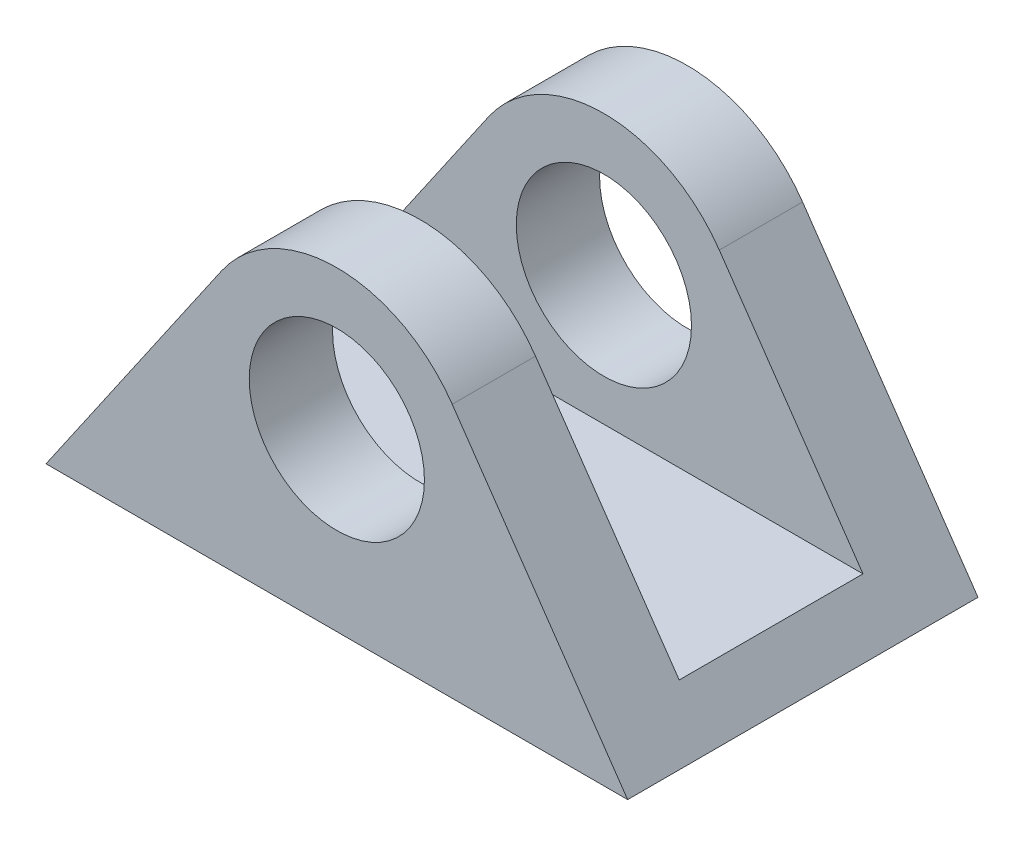
ISO-10303-21;
HEADER;
FILE_DESCRIPTION(('STEP AP214'),'2;1');
FILE_NAME('part.step','',(''),(''),'','','');
FILE_SCHEMA(('AUTOMOTIVE_DESIGN { 1 0 10303 214 1 1 1 1 }'));
ENDSEC;
DATA;
#1=APPLICATION_CONTEXT('core data for automotive mechanical design processes');
#2=APPLICATION_PROTOCOL_DEFINITION('international standard','automotive_design',2000,#1);
#3=PRODUCT_CONTEXT('',#1,'mechanical');
#4=PRODUCT('Part','Part','',(#3));
#5=PRODUCT_RELATED_PRODUCT_CATEGORY('part','',(#4));
#6=PRODUCT_DEFINITION_FORMATION('','',#4);
#7=PRODUCT_DEFINITION_CONTEXT('part definition',#1,'design');
#8=PRODUCT_DEFINITION('design','',#6,#7);
#9=PRODUCT_DEFINITION_SHAPE('','',#8);
#10=(LENGTH_UNIT() NAMED_UNIT(*) SI_UNIT(.MILLI.,.METRE.));
#11=(NAMED_UNIT(*) PLANE_ANGLE_UNIT() SI_UNIT($,.RADIAN.));
#12=(NAMED_UNIT(*) SI_UNIT($,.STERADIAN.) SOLID_ANGLE_UNIT());
#13=UNCERTAINTY_MEASURE_WITH_UNIT(LENGTH_MEASURE(1.E-05),#10,'distance_accuracy_value','');
#14=(GEOMETRIC_REPRESENTATION_CONTEXT(3) GLOBAL_UNCERTAINTY_ASSIGNED_CONTEXT((#13)) GLOBAL_UNIT_ASSIGNED_CONTEXT((#10,
#11,#12)) REPRESENTATION_CONTEXT('',''));
#15=CARTESIAN_POINT('',(0.,0.,0.));
#16=DIRECTION('',(0.,0.,1.));
#17=DIRECTION('',(1.,0.,0.));
#18=AXIS2_PLACEMENT_3D('',#15,#16,#17);
#19=CARTESIAN_POINT('',(0.,0.,20.));
#20=DIRECTION('',(0.,0.,-1.));
#21=DIRECTION('',(-1.,0.,0.));
#22=AXIS2_PLACEMENT_3D('',#19,#20,#21);
#23=CYLINDRICAL_SURFACE('',#22,8.);
#24=DIRECTION('',(0.,0.,-1.));
#25=VECTOR('',#24,1.);
#26=CARTESIAN_POINT('',(-6.58840470910797,4.5379426383554,20.));
#27=LINE('',#26,#25);
#28=CARTESIAN_POINT('',(-6.58840470910797,4.5379426383554,4.75433037321072));
#29=VERTEX_POINT('',#28);
#30=CARTESIAN_POINT('',(-6.58840470910797,4.5379426383554,0.));
#31=VERTEX_POINT('',#30);
#32=EDGE_CURVE('E156',#29,#31,#27,.T.);
#33=ORIENTED_EDGE('',*,*,#32,.F.);
#34=CARTESIAN_POINT('',(0.,0.,4.75433037321072));
#35=DIRECTION('',(0.,0.,-1.));
#36=DIRECTION('',(-1.,0.,0.));
#37=AXIS2_PLACEMENT_3D('',#34,#35,#36);
#38=CIRCLE('',#37,8.);
#39=CARTESIAN_POINT('',(6.58840470910797,4.5379426383554,4.75433037321072));
#40=VERTEX_POINT('',#39);
#41=EDGE_CURVE('E127',#29,#40,#38,.T.);
#42=ORIENTED_EDGE('',*,*,#41,.T.);
#43=DIRECTION('',(0.,0.,-1.));
#44=VECTOR('',#43,1.);
#45=CARTESIAN_POINT('',(6.58840470910797,4.5379426383554,20.));
#46=LINE('',#45,#44);
#47=CARTESIAN_POINT('',(6.58840470910797,4.5379426383554,0.));
#48=VERTEX_POINT('',#47);
#49=EDGE_CURVE('E160',#40,#48,#46,.T.);
#50=ORIENTED_EDGE('',*,*,#49,.T.);
#51=CARTESIAN_POINT('',(0.,0.,0.));
#52=DIRECTION('',(0.,0.,1.));
#53=DIRECTION('',(1.,0.,0.));
#54=AXIS2_PLACEMENT_3D('',#51,#52,#53);
#55=CIRCLE('',#54,8.);
#56=EDGE_CURVE('E125',#48,#31,#55,.T.);
#57=ORIENTED_EDGE('',*,*,#56,.T.);
#58=EDGE_LOOP('',(#33,#42,#50,#57));
#59=FACE_BOUND('',#58,.T.);
#60=ADVANCED_FACE('F35',(#59),#23,.T.);
#61=CARTESIAN_POINT('',(0.,0.,20.));
#62=DIRECTION('',(0.,0.,-1.));
#63=DIRECTION('',(-1.,0.,0.));
#64=AXIS2_PLACEMENT_3D('',#61,#62,#63);
#65=CYLINDRICAL_SURFACE('',#64,5.);
#66=CARTESIAN_POINT('',(0.,0.,4.75433037321072));
#67=DIRECTION('',(0.,0.,-1.));
#68=DIRECTION('',(-1.,0.,0.));
#69=AXIS2_PLACEMENT_3D('',#66,#67,#68);
#70=CIRCLE('',#69,5.);
#71=CARTESIAN_POINT('',(-5.,0.,4.75433037321072));
#72=VERTEX_POINT('',#71);
#73=EDGE_CURVE('E110',#72,#72,#70,.T.);
#74=ORIENTED_EDGE('',*,*,#73,.F.);
#75=EDGE_LOOP('',(#74));
#76=FACE_BOUND('',#75,.T.);
#77=CARTESIAN_POINT('',(0.,0.,0.));
#78=DIRECTION('',(0.,0.,1.));
#79=DIRECTION('',(1.,0.,0.));
#80=AXIS2_PLACEMENT_3D('',#77,#78,#79);
#81=CIRCLE('',#80,5.);
#82=CARTESIAN_POINT('',(5.,0.,0.));
#83=VERTEX_POINT('',#82);
#84=EDGE_CURVE('E134',#83,#83,#81,.T.);
#85=ORIENTED_EDGE('',*,*,#84,.F.);
#86=EDGE_LOOP('',(#85));
#87=FACE_BOUND('',#86,.T.);
#88=ADVANCED_FACE('F198',(#76,#87),#65,.F.);
#89=CARTESIAN_POINT('',(6.58840470910797,4.5379426383554,20.));
#90=DIRECTION('',(0.823550588638496,0.567242829794425,0.));
#91=DIRECTION('',(-0.567242829794425,0.823550588638496,0.));
#92=AXIS2_PLACEMENT_3D('',#89,#90,#91);
#93=PLANE('',#92);
#94=DIRECTION('',(-0.567242829794425,0.823550588638496,0.));
#95=VECTOR('',#94,1.);
#96=CARTESIAN_POINT('',(6.58840470910797,4.5379426383554,4.75433037321072));
#97=LINE('',#96,#95);
#98=CARTESIAN_POINT('',(14.7895999959564,-7.36894952715872,4.75433037321072));
#99=VERTEX_POINT('',#98);
#100=EDGE_CURVE('E122',#99,#40,#97,.T.);
#101=ORIENTED_EDGE('',*,*,#100,.F.);
#102=DIRECTION('',(0.,0.,-1.));
#103=VECTOR('',#102,1.);
#104=CARTESIAN_POINT('',(14.7895999959564,-7.36894952715872,20.));
#105=LINE('',#104,#103);
#106=CARTESIAN_POINT('',(14.7895999959564,-7.36894952715872,15.2456696267893));
#107=VERTEX_POINT('',#106);
#108=EDGE_CURVE('E115',#107,#99,#105,.T.);
#109=ORIENTED_EDGE('',*,*,#108,.F.);
#110=DIRECTION('',(0.567242829794425,-0.823550588638496,0.));
#111=VECTOR('',#110,1.);
#112=CARTESIAN_POINT('',(6.58840470910797,4.5379426383554,15.2456696267893));
#113=LINE('',#112,#111);
#114=CARTESIAN_POINT('',(6.58840470910797,4.5379426383554,15.2456696267893));
#115=VERTEX_POINT('',#114);
#116=EDGE_CURVE('E104',#115,#107,#113,.T.);
#117=ORIENTED_EDGE('',*,*,#116,.F.);
#118=CARTESIAN_POINT('',(6.58840470910797,4.5379426383554,20.));
#119=VERTEX_POINT('',#118);
#120=EDGE_CURVE('E43',#119,#115,#46,.T.);
#121=ORIENTED_EDGE('',*,*,#120,.F.);
#122=DIRECTION('',(0.567242829794425,-0.823550588638496,0.));
#123=VECTOR('',#122,1.);
#124=CARTESIAN_POINT('',(6.58840470910797,4.5379426383554,20.));
#125=LINE('',#124,#123);
#126=CARTESIAN_POINT('',(16.601807450041,-10.,20.));
#127=VERTEX_POINT('',#126);
#128=EDGE_CURVE('E131',#119,#127,#125,.T.);
#129=ORIENTED_EDGE('',*,*,#128,.T.);
#130=DIRECTION('',(0.,0.,-1.));
#131=VECTOR('',#130,1.);
#132=CARTESIAN_POINT('',(16.601807450041,-10.,20.));
#133=LINE('',#132,#131);
#134=CARTESIAN_POINT('',(16.601807450041,-10.,0.));
#135=VERTEX_POINT('',#134);
#136=EDGE_CURVE('E59',#127,#135,#133,.T.);
#137=ORIENTED_EDGE('',*,*,#136,.T.);
#138=DIRECTION('',(0.567242829794425,-0.823550588638496,0.));
#139=VECTOR('',#138,1.);
#140=CARTESIAN_POINT('',(6.58840470910797,4.5379426383554,0.));
#141=LINE('',#140,#139);
#142=EDGE_CURVE('E123',#48,#135,#141,.T.);
#143=ORIENTED_EDGE('',*,*,#142,.F.);
#144=ORIENTED_EDGE('',*,*,#49,.F.);
#145=EDGE_LOOP('',(#101,#109,#117,#121,#129,#137,#143,#144));
#146=FACE_BOUND('',#145,.T.);
#147=ADVANCED_FACE('F37',(#146),#93,.T.);
#148=ORIENTED_EDGE('',*,*,#120,.T.);
#149=CARTESIAN_POINT('',(0.,0.,15.2456696267893));
#150=DIRECTION('',(0.,0.,1.));
#151=DIRECTION('',(1.,0.,0.));
#152=AXIS2_PLACEMENT_3D('',#149,#150,#151);
#153=CIRCLE('',#152,8.);
#154=CARTESIAN_POINT('',(-6.58840470910797,4.5379426383554,15.2456696267893));
#155=VERTEX_POINT('',#154);
#156=EDGE_CURVE('E108',#115,#155,#153,.T.);
#157=ORIENTED_EDGE('',*,*,#156,.T.);
#158=CARTESIAN_POINT('',(-6.58840470910797,4.5379426383554,20.));
#159=VERTEX_POINT('',#158);
#160=EDGE_CURVE('E157',#159,#155,#27,.T.);
#161=ORIENTED_EDGE('',*,*,#160,.F.);
#162=CARTESIAN_POINT('',(0.,0.,20.));
#163=DIRECTION('',(0.,0.,1.));
#164=DIRECTION('',(1.,0.,0.));
#165=AXIS2_PLACEMENT_3D('',#162,#163,#164);
#166=CIRCLE('',#165,8.);
#167=EDGE_CURVE('E133',#119,#159,#166,.T.);
#168=ORIENTED_EDGE('',*,*,#167,.F.);
#169=EDGE_LOOP('',(#148,#157,#161,#168));
#170=FACE_BOUND('',#169,.T.);
#171=ADVANCED_FACE('F183',(#170),#23,.T.);
#172=CARTESIAN_POINT('',(-6.58840470910797,4.5379426383554,20.));
#173=DIRECTION('',(0.823550588638496,-0.567242829794425,0.));
#174=DIRECTION('',(0.567242829794425,0.823550588638496,0.));
#175=AXIS2_PLACEMENT_3D('',#172,#173,#174);
#176=PLANE('',#175);
#177=DIRECTION('',(0.,0.,-1.));
#178=VECTOR('',#177,1.);
#179=CARTESIAN_POINT('',(-14.7895999959564,-7.36894952715872,20.));
#180=LINE('',#179,#178);
#181=CARTESIAN_POINT('',(-14.7895999959564,-7.36894952715872,15.2456696267893));
#182=VERTEX_POINT('',#181);
#183=CARTESIAN_POINT('',(-14.7895999959564,-7.36894952715872,4.75433037321072));
#184=VERTEX_POINT('',#183);
#185=EDGE_CURVE('E11',#182,#184,#180,.T.);
#186=ORIENTED_EDGE('',*,*,#185,.T.);
#187=DIRECTION('',(0.567242829794425,0.823550588638496,0.));
#188=VECTOR('',#187,1.);
#189=CARTESIAN_POINT('',(-6.58840470910797,4.5379426383554,4.75433037321072));
#190=LINE('',#189,#188);
#191=EDGE_CURVE('E166',#184,#29,#190,.T.);
#192=ORIENTED_EDGE('',*,*,#191,.T.);
#193=ORIENTED_EDGE('',*,*,#32,.T.);
#194=DIRECTION('',(-0.567242829794425,-0.823550588638496,0.));
#195=VECTOR('',#194,1.);
#196=CARTESIAN_POINT('',(-6.58840470910797,4.5379426383554,0.));
#197=LINE('',#196,#195);
#198=CARTESIAN_POINT('',(-16.601807450041,-10.,0.));
#199=VERTEX_POINT('',#198);
#200=EDGE_CURVE('E145',#31,#199,#197,.T.);
#201=ORIENTED_EDGE('',*,*,#200,.T.);
#202=DIRECTION('',(0.,0.,-1.));
#203=VECTOR('',#202,1.);
#204=CARTESIAN_POINT('',(-16.601807450041,-10.,20.));
#205=LINE('',#204,#203);
#206=CARTESIAN_POINT('',(-16.601807450041,-10.,20.));
#207=VERTEX_POINT('',#206);
#208=EDGE_CURVE('E154',#207,#199,#205,.T.);
#209=ORIENTED_EDGE('',*,*,#208,.F.);
#210=DIRECTION('',(-0.567242829794425,-0.823550588638496,0.));
#211=VECTOR('',#210,1.);
#212=CARTESIAN_POINT('',(-6.58840470910797,4.5379426383554,20.));
#213=LINE('',#212,#211);
#214=EDGE_CURVE('E136',#159,#207,#213,.T.);
#215=ORIENTED_EDGE('',*,*,#214,.F.);
#216=ORIENTED_EDGE('',*,*,#160,.T.);
#217=DIRECTION('',(-0.567242829794425,-0.823550588638496,0.));
#218=VECTOR('',#217,1.);
#219=CARTESIAN_POINT('',(-6.58840470910797,4.5379426383554,15.2456696267893));
#220=LINE('',#219,#218);
#221=EDGE_CURVE('E164',#155,#182,#220,.T.);
#222=ORIENTED_EDGE('',*,*,#221,.T.);
#223=EDGE_LOOP('',(#186,#192,#193,#201,#209,#215,#216,#222));
#224=FACE_BOUND('',#223,.T.);
#225=ADVANCED_FACE('F179',(#224),#176,.F.);
#226=CARTESIAN_POINT('',(0.,-10.,20.));
#227=DIRECTION('',(0.,-1.,0.));
#228=DIRECTION('',(1.,0.,0.));
#229=AXIS2_PLACEMENT_3D('',#226,#227,#228);
#230=PLANE('',#229);
#231=DIRECTION('',(-1.,0.,0.));
#232=VECTOR('',#231,1.);
#233=CARTESIAN_POINT('',(0.,-10.,0.));
#234=LINE('',#233,#232);
#235=EDGE_CURVE('E148',#135,#199,#234,.T.);
#236=ORIENTED_EDGE('',*,*,#235,.F.);
#237=ORIENTED_EDGE('',*,*,#136,.F.);
#238=DIRECTION('',(-1.,0.,0.));
#239=VECTOR('',#238,1.);
#240=CARTESIAN_POINT('',(0.,-10.,20.));
#241=LINE('',#240,#239);
#242=EDGE_CURVE('E138',#127,#207,#241,.T.);
#243=ORIENTED_EDGE('',*,*,#242,.T.);
#244=ORIENTED_EDGE('',*,*,#208,.T.);
#245=EDGE_LOOP('',(#236,#237,#243,#244));
#246=FACE_BOUND('',#245,.T.);
#247=ADVANCED_FACE('F190',(#246),#230,.T.);
#248=CARTESIAN_POINT('',(0.,0.,15.2456696267893));
#249=DIRECTION('',(0.,0.,1.));
#250=DIRECTION('',(1.,0.,0.));
#251=AXIS2_PLACEMENT_3D('',#248,#249,#250);
#252=CIRCLE('',#251,5.);
#253=CARTESIAN_POINT('',(5.,0.,15.2456696267893));
#254=VERTEX_POINT('',#253);
#255=EDGE_CURVE('E162',#254,#254,#252,.T.);
#256=ORIENTED_EDGE('',*,*,#255,.F.);
#257=EDGE_LOOP('',(#256));
#258=FACE_BOUND('',#257,.T.);
#259=CARTESIAN_POINT('',(0.,0.,20.));
#260=DIRECTION('',(0.,0.,1.));
#261=DIRECTION('',(1.,0.,0.));
#262=AXIS2_PLACEMENT_3D('',#259,#260,#261);
#263=CIRCLE('',#262,5.);
#264=CARTESIAN_POINT('',(5.,0.,20.));
#265=VERTEX_POINT('',#264);
#266=EDGE_CURVE('E140',#265,#265,#263,.T.);
#267=ORIENTED_EDGE('',*,*,#266,.T.);
#268=EDGE_LOOP('',(#267));
#269=FACE_BOUND('',#268,.T.);
#270=ADVANCED_FACE('F204',(#258,#269),#65,.F.);
#271=CARTESIAN_POINT('',(0.,0.,20.));
#272=DIRECTION('',(0.,0.,1.));
#273=DIRECTION('',(1.,0.,0.));
#274=AXIS2_PLACEMENT_3D('',#271,#272,#273);
#275=PLANE('',#274);
#276=ORIENTED_EDGE('',*,*,#128,.F.);
#277=ORIENTED_EDGE('',*,*,#167,.T.);
#278=ORIENTED_EDGE('',*,*,#214,.T.);
#279=ORIENTED_EDGE('',*,*,#242,.F.);
#280=EDGE_LOOP('',(#276,#277,#278,#279));
#281=FACE_BOUND('',#280,.T.);
#282=ORIENTED_EDGE('',*,*,#266,.F.);
#283=EDGE_LOOP('',(#282));
#284=FACE_BOUND('',#283,.T.);
#285=ADVANCED_FACE('F187',(#281,#284),#275,.T.);
#286=CARTESIAN_POINT('',(0.,0.,0.));
#287=DIRECTION('',(0.,0.,1.));
#288=DIRECTION('',(1.,0.,0.));
#289=AXIS2_PLACEMENT_3D('',#286,#287,#288);
#290=PLANE('',#289);
#291=ORIENTED_EDGE('',*,*,#142,.T.);
#292=ORIENTED_EDGE('',*,*,#235,.T.);
#293=ORIENTED_EDGE('',*,*,#200,.F.);
#294=ORIENTED_EDGE('',*,*,#56,.F.);
#295=EDGE_LOOP('',(#291,#292,#293,#294));
#296=FACE_BOUND('',#295,.T.);
#297=ORIENTED_EDGE('',*,*,#84,.T.);
#298=EDGE_LOOP('',(#297));
#299=FACE_BOUND('',#298,.T.);
#300=ADVANCED_FACE('F194',(#296,#299),#290,.F.);
#301=CARTESIAN_POINT('',(-16.601807450041,-7.36894952715872,15.2456696267893));
#302=DIRECTION('',(0.,-1.,0.));
#303=DIRECTION('',(0.,0.,-1.));
#304=AXIS2_PLACEMENT_3D('',#301,#302,#303);
#305=PLANE('',#304);
#306=ORIENTED_EDGE('',*,*,#108,.T.);
#307=DIRECTION('',(1.,0.,0.));
#308=VECTOR('',#307,1.);
#309=CARTESIAN_POINT('',(-16.601807450041,-7.36894952715872,4.75433037321072));
#310=LINE('',#309,#308);
#311=EDGE_CURVE('E118',#184,#99,#310,.T.);
#312=ORIENTED_EDGE('',*,*,#311,.F.);
#313=ORIENTED_EDGE('',*,*,#185,.F.);
#314=DIRECTION('',(1.,0.,0.));
#315=VECTOR('',#314,1.);
#316=CARTESIAN_POINT('',(-16.601807450041,-7.36894952715872,15.2456696267893));
#317=LINE('',#316,#315);
#318=EDGE_CURVE('E50',#182,#107,#317,.T.);
#319=ORIENTED_EDGE('',*,*,#318,.T.);
#320=EDGE_LOOP('',(#306,#312,#313,#319));
#321=FACE_BOUND('',#320,.T.);
#322=ADVANCED_FACE('F113',(#321),#305,.F.);
#323=CARTESIAN_POINT('',(-16.601807450041,11.9220774205029,4.75433037321072));
#324=DIRECTION('',(0.,0.,-1.));
#325=DIRECTION('',(-1.,0.,0.));
#326=AXIS2_PLACEMENT_3D('',#323,#324,#325);
#327=PLANE('',#326);
#328=ORIENTED_EDGE('',*,*,#100,.T.);
#329=ORIENTED_EDGE('',*,*,#41,.F.);
#330=ORIENTED_EDGE('',*,*,#191,.F.);
#331=ORIENTED_EDGE('',*,*,#311,.T.);
#332=EDGE_LOOP('',(#328,#329,#330,#331));
#333=FACE_BOUND('',#332,.T.);
#334=ORIENTED_EDGE('',*,*,#73,.T.);
#335=EDGE_LOOP('',(#334));
#336=FACE_BOUND('',#335,.T.);
#337=ADVANCED_FACE('F178',(#333,#336),#327,.F.);
#338=CARTESIAN_POINT('',(-16.601807450041,11.9220774205029,15.2456696267893));
#339=DIRECTION('',(0.,0.,1.));
#340=DIRECTION('',(1.,0.,0.));
#341=AXIS2_PLACEMENT_3D('',#338,#339,#340);
#342=PLANE('',#341);
#343=ORIENTED_EDGE('',*,*,#116,.T.);
#344=ORIENTED_EDGE('',*,*,#318,.F.);
#345=ORIENTED_EDGE('',*,*,#221,.F.);
#346=ORIENTED_EDGE('',*,*,#156,.F.);
#347=EDGE_LOOP('',(#343,#344,#345,#346));
#348=FACE_BOUND('',#347,.T.);
#349=ORIENTED_EDGE('',*,*,#255,.T.);
#350=EDGE_LOOP('',(#349));
#351=FACE_BOUND('',#350,.T.);
#352=ADVANCED_FACE('F105',(#348,#351),#342,.F.);
#353=CLOSED_SHELL('',(#60,#88,#147,#171,#225,#247,#270,#285,#300,#322,#337,#352));
#354=MANIFOLD_SOLID_BREP('B2',#353);
#355=ADVANCED_BREP_SHAPE_REPRESENTATION('',(#18,#354),#14);
#356=SHAPE_DEFINITION_REPRESENTATION(#9,#355);
ENDSEC;
END-ISO-10303-21;
